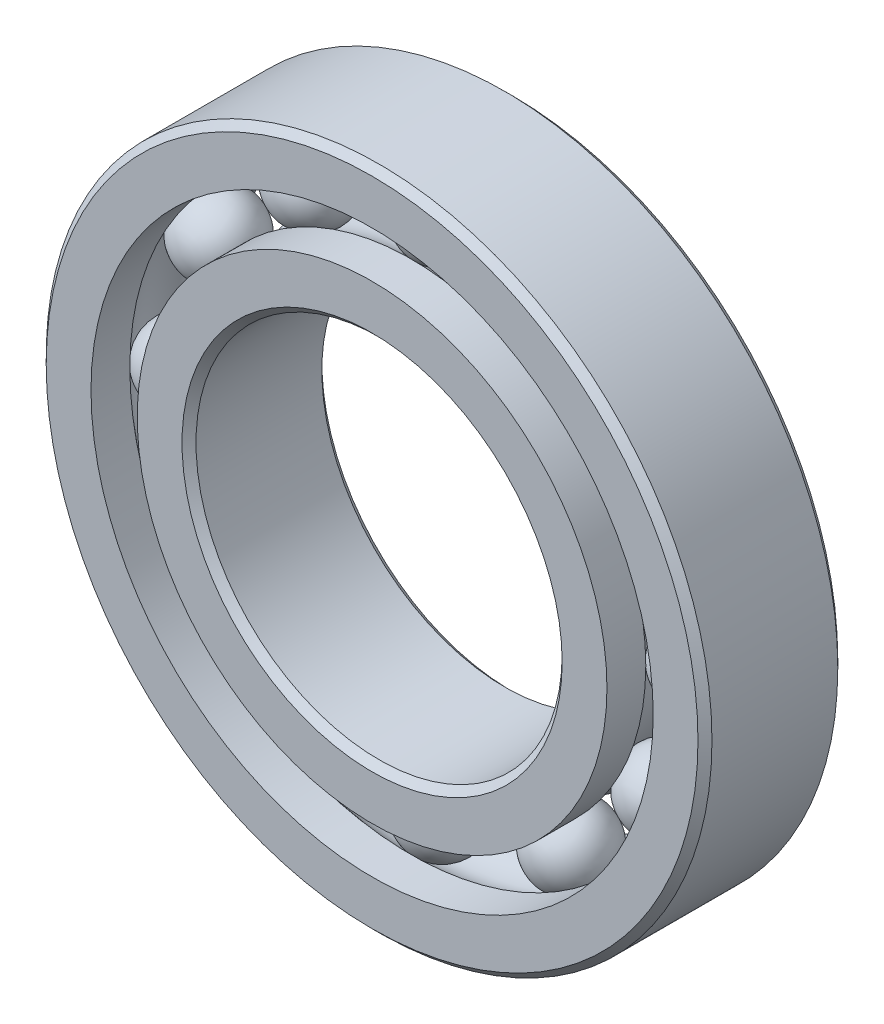
ISO-10303-21;
HEADER;
FILE_DESCRIPTION(('STEP AP214'),'2;1');
FILE_NAME('part.step','',(''),(''),'','','');
FILE_SCHEMA(('AUTOMOTIVE_DESIGN { 1 0 10303 214 1 1 1 1 }'));
ENDSEC;
DATA;
#1=APPLICATION_CONTEXT('core data for automotive mechanical design processes');
#2=APPLICATION_PROTOCOL_DEFINITION('international standard','automotive_design',2000,#1);
#3=PRODUCT_CONTEXT('',#1,'mechanical');
#4=PRODUCT('Part','Part','',(#3));
#5=PRODUCT_RELATED_PRODUCT_CATEGORY('part','',(#4));
#6=PRODUCT_DEFINITION_FORMATION('','',#4);
#7=PRODUCT_DEFINITION_CONTEXT('part definition',#1,'design');
#8=PRODUCT_DEFINITION('design','',#6,#7);
#9=PRODUCT_DEFINITION_SHAPE('','',#8);
#10=(LENGTH_UNIT() NAMED_UNIT(*) SI_UNIT(.MILLI.,.METRE.));
#11=(NAMED_UNIT(*) PLANE_ANGLE_UNIT() SI_UNIT($,.RADIAN.));
#12=(NAMED_UNIT(*) SI_UNIT($,.STERADIAN.) SOLID_ANGLE_UNIT());
#13=UNCERTAINTY_MEASURE_WITH_UNIT(LENGTH_MEASURE(1.E-05),#10,'distance_accuracy_value','');
#14=(GEOMETRIC_REPRESENTATION_CONTEXT(3) GLOBAL_UNCERTAINTY_ASSIGNED_CONTEXT((#13)) GLOBAL_UNIT_ASSIGNED_CONTEXT((#10,
#11,#12)) REPRESENTATION_CONTEXT('',''));
#15=CARTESIAN_POINT('',(0.,0.,0.));
#16=DIRECTION('',(0.,0.,1.));
#17=DIRECTION('',(1.,0.,0.));
#18=AXIS2_PLACEMENT_3D('',#15,#16,#17);
#19=CARTESIAN_POINT('',(-19.3749999999996,33.5584843966472,0.));
#20=DIRECTION('',(0.,0.,1.));
#21=DIRECTION('',(-0.499999999999989,0.866025403784445,0.));
#22=AXIS2_PLACEMENT_3D('',#19,#20,#21);
#23=SPHERICAL_SURFACE('',#22,5.81689133689428);
#24=CARTESIAN_POINT('',(-19.3749999999996,33.5584843966472,5.81689133689428));
#25=VERTEX_POINT('',#24);
#26=VERTEX_LOOP('',#25);
#27=FACE_BOUND('',#26,.T.);
#28=ADVANCED_FACE('F38',(#27),#23,.T.);
#29=CLOSED_SHELL('',(#28));
#30=MANIFOLD_SOLID_BREP('B2',#29);
#31=CARTESIAN_POINT('',(-33.5584843966468,19.3750000000004,0.));
#32=DIRECTION('',(0.,0.,1.));
#33=DIRECTION('',(-0.866025403784433,0.50000000000001,0.));
#34=AXIS2_PLACEMENT_3D('',#31,#32,#33);
#35=SPHERICAL_SURFACE('',#34,5.81689133689428);
#36=CARTESIAN_POINT('',(-33.5584843966468,19.3750000000004,5.81689133689428));
#37=VERTEX_POINT('',#36);
#38=VERTEX_LOOP('',#37);
#39=FACE_BOUND('',#38,.T.);
#40=ADVANCED_FACE('F59',(#39),#35,.T.);
#41=CLOSED_SHELL('',(#40));
#42=MANIFOLD_SOLID_BREP('B6',#41);
#43=CARTESIAN_POINT('',(-38.75,4.05884705640514E-13,0.));
#44=DIRECTION('',(0.,0.,1.));
#45=DIRECTION('',(-1.,0.,0.));
#46=AXIS2_PLACEMENT_3D('',#43,#44,#45);
#47=SPHERICAL_SURFACE('',#46,5.81689133689428);
#48=CARTESIAN_POINT('',(-38.75,4.05884705640514E-13,5.81689133689428));
#49=VERTEX_POINT('',#48);
#50=VERTEX_LOOP('',#49);
#51=FACE_BOUND('',#50,.T.);
#52=ADVANCED_FACE('F80',(#51),#47,.T.);
#53=CLOSED_SHELL('',(#52));
#54=MANIFOLD_SOLID_BREP('B34',#53);
#55=CARTESIAN_POINT('',(-33.5584843966472,-19.3749999999997,0.));
#56=DIRECTION('',(0.,0.,1.));
#57=DIRECTION('',(-0.866025403784443,-0.499999999999992,0.));
#58=AXIS2_PLACEMENT_3D('',#55,#56,#57);
#59=SPHERICAL_SURFACE('',#58,5.81689133689428);
#60=CARTESIAN_POINT('',(-33.5584843966472,-19.3749999999997,5.81689133689428));
#61=VERTEX_POINT('',#60);
#62=VERTEX_LOOP('',#61);
#63=FACE_BOUND('',#62,.T.);
#64=ADVANCED_FACE('F101',(#63),#59,.T.);
#65=CLOSED_SHELL('',(#64));
#66=MANIFOLD_SOLID_BREP('B55',#65);
#67=CARTESIAN_POINT('',(-19.3750000000003,-33.5584843966468,0.));
#68=DIRECTION('',(0.,0.,1.));
#69=DIRECTION('',(-0.500000000000007,-0.866025403784435,0.));
#70=AXIS2_PLACEMENT_3D('',#67,#68,#69);
#71=SPHERICAL_SURFACE('',#70,5.81689133689428);
#72=CARTESIAN_POINT('',(-19.3750000000003,-33.5584843966468,5.81689133689428));
#73=VERTEX_POINT('',#72);
#74=VERTEX_LOOP('',#73);
#75=FACE_BOUND('',#74,.T.);
#76=ADVANCED_FACE('F122',(#75),#71,.T.);
#77=CLOSED_SHELL('',(#76));
#78=MANIFOLD_SOLID_BREP('B76',#77);
#79=CARTESIAN_POINT('',(-2.70589803760343E-13,-38.75,0.));
#80=DIRECTION('',(0.,0.,1.));
#81=DIRECTION('',(0.,-1.,0.));
#82=AXIS2_PLACEMENT_3D('',#79,#80,#81);
#83=SPHERICAL_SURFACE('',#82,5.81689133689428);
#84=CARTESIAN_POINT('',(-2.70589803760343E-13,-38.75,5.81689133689428));
#85=VERTEX_POINT('',#84);
#86=VERTEX_LOOP('',#85);
#87=FACE_BOUND('',#86,.T.);
#88=ADVANCED_FACE('F143',(#87),#83,.T.);
#89=CLOSED_SHELL('',(#88));
#90=MANIFOLD_SOLID_BREP('B97',#89);
#91=CARTESIAN_POINT('',(19.3749999999998,-33.5584843966471,0.));
#92=DIRECTION('',(0.,0.,1.));
#93=DIRECTION('',(0.499999999999995,-0.866025403784442,0.));
#94=AXIS2_PLACEMENT_3D('',#91,#92,#93);
#95=SPHERICAL_SURFACE('',#94,5.81689133689428);
#96=CARTESIAN_POINT('',(19.3749999999998,-33.5584843966471,5.81689133689428));
#97=VERTEX_POINT('',#96);
#98=VERTEX_LOOP('',#97);
#99=FACE_BOUND('',#98,.T.);
#100=ADVANCED_FACE('F164',(#99),#95,.T.);
#101=CLOSED_SHELL('',(#100));
#102=MANIFOLD_SOLID_BREP('B118',#101);
#103=CARTESIAN_POINT('',(33.5584843966469,-19.3750000000002,0.));
#104=DIRECTION('',(0.,0.,1.));
#105=DIRECTION('',(0.866025403784436,-0.500000000000004,0.));
#106=AXIS2_PLACEMENT_3D('',#103,#104,#105);
#107=SPHERICAL_SURFACE('',#106,5.81689133689428);
#108=CARTESIAN_POINT('',(33.5584843966469,-19.3750000000002,5.81689133689428));
#109=VERTEX_POINT('',#108);
#110=VERTEX_LOOP('',#109);
#111=FACE_BOUND('',#110,.T.);
#112=ADVANCED_FACE('F185',(#111),#107,.T.);
#113=CLOSED_SHELL('',(#112));
#114=MANIFOLD_SOLID_BREP('B139',#113);
#115=CARTESIAN_POINT('',(38.75,-1.35294901880171E-13,0.));
#116=DIRECTION('',(0.,0.,1.));
#117=DIRECTION('',(1.,0.,0.));
#118=AXIS2_PLACEMENT_3D('',#115,#116,#117);
#119=SPHERICAL_SURFACE('',#118,5.81689133689428);
#120=CARTESIAN_POINT('',(38.75,-1.35294901880171E-13,5.81689133689428));
#121=VERTEX_POINT('',#120);
#122=VERTEX_LOOP('',#121);
#123=FACE_BOUND('',#122,.T.);
#124=ADVANCED_FACE('F206',(#123),#119,.T.);
#125=CLOSED_SHELL('',(#124));
#126=MANIFOLD_SOLID_BREP('B160',#125);
#127=CARTESIAN_POINT('',(33.558484396647,19.3749999999999,0.));
#128=DIRECTION('',(0.,0.,1.));
#129=DIRECTION('',(0.86602540378444,0.499999999999998,0.));
#130=AXIS2_PLACEMENT_3D('',#127,#128,#129);
#131=SPHERICAL_SURFACE('',#130,5.81689133689428);
#132=CARTESIAN_POINT('',(33.558484396647,19.3749999999999,5.81689133689428));
#133=VERTEX_POINT('',#132);
#134=VERTEX_LOOP('',#133);
#135=FACE_BOUND('',#134,.T.);
#136=ADVANCED_FACE('F227',(#135),#131,.T.);
#137=CLOSED_SHELL('',(#136));
#138=MANIFOLD_SOLID_BREP('B181',#137);
#139=CARTESIAN_POINT('',(19.375,33.558484396647,0.));
#140=DIRECTION('',(0.,0.,1.));
#141=DIRECTION('',(0.500000000000001,0.866025403784438,0.));
#142=AXIS2_PLACEMENT_3D('',#139,#140,#141);
#143=SPHERICAL_SURFACE('',#142,5.81689133689428);
#144=CARTESIAN_POINT('',(19.375,33.558484396647,5.81689133689428));
#145=VERTEX_POINT('',#144);
#146=VERTEX_LOOP('',#145);
#147=FACE_BOUND('',#146,.T.);
#148=ADVANCED_FACE('F248',(#147),#143,.T.);
#149=CLOSED_SHELL('',(#148));
#150=MANIFOLD_SOLID_BREP('B202',#149);
#151=CARTESIAN_POINT('',(0.,38.75,0.));
#152=DIRECTION('',(0.,0.,1.));
#153=DIRECTION('',(0.,1.,0.));
#154=AXIS2_PLACEMENT_3D('',#151,#152,#153);
#155=SPHERICAL_SURFACE('',#154,5.81689133689428);
#156=CARTESIAN_POINT('',(0.,38.75,5.81689133689428));
#157=VERTEX_POINT('',#156);
#158=VERTEX_LOOP('',#157);
#159=FACE_BOUND('',#158,.T.);
#160=ADVANCED_FACE('F271',(#159),#155,.T.);
#161=CLOSED_SHELL('',(#160));
#162=MANIFOLD_SOLID_BREP('B223',#161);
#163=CARTESIAN_POINT('',(0.,35.2774725274725,10.5));
#164=DIRECTION('',(0.,0.,-1.));
#165=DIRECTION('',(-1.,0.,0.));
#166=AXIS2_PLACEMENT_3D('',#163,#164,#165);
#167=PLANE('',#166);
#168=CARTESIAN_POINT('',(0.,0.,10.5));
#169=DIRECTION('',(0.,0.,1.));
#170=DIRECTION('',(1.,0.,0.));
#171=AXIS2_PLACEMENT_3D('',#168,#169,#170);
#172=CIRCLE('',#171,28.55);
#173=CARTESIAN_POINT('',(28.55,0.,10.5));
#174=VERTEX_POINT('',#173);
#175=EDGE_CURVE('E319',#174,#174,#172,.T.);
#176=ORIENTED_EDGE('',*,*,#175,.F.);
#177=EDGE_LOOP('',(#176));
#178=FACE_BOUND('',#177,.T.);
#179=CARTESIAN_POINT('',(0.,0.,10.5));
#180=DIRECTION('',(0.,0.,1.));
#181=DIRECTION('',(1.,0.,0.));
#182=AXIS2_PLACEMENT_3D('',#179,#180,#181);
#183=CIRCLE('',#182,35.2774725274725);
#184=CARTESIAN_POINT('',(35.2774725274725,0.,10.5));
#185=VERTEX_POINT('',#184);
#186=EDGE_CURVE('E270',#185,#185,#183,.T.);
#187=ORIENTED_EDGE('',*,*,#186,.T.);
#188=EDGE_LOOP('',(#187));
#189=FACE_BOUND('',#188,.T.);
#190=ADVANCED_FACE('F291',(#178,#189),#167,.F.);
#191=CARTESIAN_POINT('',(0.,0.,10.5));
#192=DIRECTION('',(0.,0.,1.));
#193=DIRECTION('',(1.,0.,0.));
#194=AXIS2_PLACEMENT_3D('',#191,#192,#193);
#195=CYLINDRICAL_SURFACE('',#194,35.2774725274725);
#196=ORIENTED_EDGE('',*,*,#186,.F.);
#197=EDGE_LOOP('',(#196));
#198=FACE_BOUND('',#197,.T.);
#199=CARTESIAN_POINT('',(0.,0.,4.66666666666667));
#200=DIRECTION('',(0.,0.,1.));
#201=DIRECTION('',(1.,0.,0.));
#202=AXIS2_PLACEMENT_3D('',#199,#200,#201);
#203=CIRCLE('',#202,35.2774725274725);
#204=CARTESIAN_POINT('',(35.2774725274725,0.,4.66666666666667));
#205=VERTEX_POINT('',#204);
#206=EDGE_CURVE('E297',#205,#205,#203,.T.);
#207=ORIENTED_EDGE('',*,*,#206,.T.);
#208=EDGE_LOOP('',(#207));
#209=FACE_BOUND('',#208,.T.);
#210=ADVANCED_FACE('F326',(#198,#209),#195,.T.);
#211=CARTESIAN_POINT('',(0.,0.,0.));
#212=DIRECTION('',(0.,0.,1.));
#213=DIRECTION('',(1.,0.,0.));
#214=AXIS2_PLACEMENT_3D('',#211,#212,#213);
#215=TOROIDAL_SURFACE('',#214,38.75,5.81689133689427);
#216=ORIENTED_EDGE('',*,*,#206,.F.);
#217=EDGE_LOOP('',(#216));
#218=FACE_BOUND('',#217,.T.);
#219=CARTESIAN_POINT('',(0.,0.,-4.66666666666667));
#220=DIRECTION('',(0.,0.,1.));
#221=DIRECTION('',(1.,0.,0.));
#222=AXIS2_PLACEMENT_3D('',#219,#220,#221);
#223=CIRCLE('',#222,35.2774725274725);
#224=CARTESIAN_POINT('',(35.2774725274725,0.,-4.66666666666667));
#225=VERTEX_POINT('',#224);
#226=EDGE_CURVE('E301',#225,#225,#223,.T.);
#227=ORIENTED_EDGE('',*,*,#226,.T.);
#228=EDGE_LOOP('',(#227));
#229=FACE_BOUND('',#228,.T.);
#230=ADVANCED_FACE('F330',(#218,#229),#215,.F.);
#231=CARTESIAN_POINT('',(0.,0.,10.5));
#232=DIRECTION('',(0.,0.,1.));
#233=DIRECTION('',(1.,0.,0.));
#234=AXIS2_PLACEMENT_3D('',#231,#232,#233);
#235=CYLINDRICAL_SURFACE('',#234,35.2774725274725);
#236=ORIENTED_EDGE('',*,*,#226,.F.);
#237=EDGE_LOOP('',(#236));
#238=FACE_BOUND('',#237,.T.);
#239=CARTESIAN_POINT('',(0.,0.,-10.5));
#240=DIRECTION('',(0.,0.,1.));
#241=DIRECTION('',(1.,0.,0.));
#242=AXIS2_PLACEMENT_3D('',#239,#240,#241);
#243=CIRCLE('',#242,35.2774725274725);
#244=CARTESIAN_POINT('',(35.2774725274725,0.,-10.5));
#245=VERTEX_POINT('',#244);
#246=EDGE_CURVE('E305',#245,#245,#243,.T.);
#247=ORIENTED_EDGE('',*,*,#246,.T.);
#248=EDGE_LOOP('',(#247));
#249=FACE_BOUND('',#248,.T.);
#250=ADVANCED_FACE('F335',(#238,#249),#235,.T.);
#251=CARTESIAN_POINT('',(0.,28.55,-10.5));
#252=DIRECTION('',(0.,0.,1.));
#253=DIRECTION('',(1.,0.,0.));
#254=AXIS2_PLACEMENT_3D('',#251,#252,#253);
#255=PLANE('',#254);
#256=ORIENTED_EDGE('',*,*,#246,.F.);
#257=EDGE_LOOP('',(#256));
#258=FACE_BOUND('',#257,.T.);
#259=CARTESIAN_POINT('',(0.,0.,-10.5));
#260=DIRECTION('',(0.,0.,1.));
#261=DIRECTION('',(1.,0.,0.));
#262=AXIS2_PLACEMENT_3D('',#259,#260,#261);
#263=CIRCLE('',#262,28.55);
#264=CARTESIAN_POINT('',(28.55,0.,-10.5));
#265=VERTEX_POINT('',#264);
#266=EDGE_CURVE('E310',#265,#265,#263,.T.);
#267=ORIENTED_EDGE('',*,*,#266,.T.);
#268=EDGE_LOOP('',(#267));
#269=FACE_BOUND('',#268,.T.);
#270=ADVANCED_FACE('F341',(#258,#269),#255,.F.);
#271=CARTESIAN_POINT('',(0.,0.,-9.45000000000001));
#272=DIRECTION('',(0.,0.,-1.));
#273=DIRECTION('',(-1.,0.,0.));
#274=AXIS2_PLACEMENT_3D('',#271,#272,#273);
#275=CONICAL_SURFACE('',#274,27.5,0.785398163397453);
#276=ORIENTED_EDGE('',*,*,#266,.F.);
#277=EDGE_LOOP('',(#276));
#278=FACE_BOUND('',#277,.T.);
#279=CARTESIAN_POINT('',(0.,0.,-9.45000000000001));
#280=DIRECTION('',(0.,0.,1.));
#281=DIRECTION('',(1.,0.,0.));
#282=AXIS2_PLACEMENT_3D('',#279,#280,#281);
#283=CIRCLE('',#282,27.5);
#284=CARTESIAN_POINT('',(27.5,0.,-9.45000000000001));
#285=VERTEX_POINT('',#284);
#286=EDGE_CURVE('E313',#285,#285,#283,.T.);
#287=ORIENTED_EDGE('',*,*,#286,.T.);
#288=EDGE_LOOP('',(#287));
#289=FACE_BOUND('',#288,.T.);
#290=ADVANCED_FACE('F345',(#278,#289),#275,.F.);
#291=CARTESIAN_POINT('',(0.,0.,10.5));
#292=DIRECTION('',(0.,0.,1.));
#293=DIRECTION('',(1.,0.,0.));
#294=AXIS2_PLACEMENT_3D('',#291,#292,#293);
#295=CYLINDRICAL_SURFACE('',#294,27.5);
#296=ORIENTED_EDGE('',*,*,#286,.F.);
#297=EDGE_LOOP('',(#296));
#298=FACE_BOUND('',#297,.T.);
#299=CARTESIAN_POINT('',(0.,0.,9.45));
#300=DIRECTION('',(0.,0.,1.));
#301=DIRECTION('',(1.,0.,0.));
#302=AXIS2_PLACEMENT_3D('',#299,#300,#301);
#303=CIRCLE('',#302,27.5);
#304=CARTESIAN_POINT('',(27.5,0.,9.45));
#305=VERTEX_POINT('',#304);
#306=EDGE_CURVE('E316',#305,#305,#303,.T.);
#307=ORIENTED_EDGE('',*,*,#306,.T.);
#308=EDGE_LOOP('',(#307));
#309=FACE_BOUND('',#308,.T.);
#310=ADVANCED_FACE('F349',(#298,#309),#295,.F.);
#311=CARTESIAN_POINT('',(0.,0.,10.5));
#312=DIRECTION('',(0.,0.,1.));
#313=DIRECTION('',(1.,0.,0.));
#314=AXIS2_PLACEMENT_3D('',#311,#312,#313);
#315=CONICAL_SURFACE('',#314,28.55,0.785398163397441);
#316=ORIENTED_EDGE('',*,*,#306,.F.);
#317=EDGE_LOOP('',(#316));
#318=FACE_BOUND('',#317,.T.);
#319=ORIENTED_EDGE('',*,*,#175,.T.);
#320=EDGE_LOOP('',(#319));
#321=FACE_BOUND('',#320,.T.);
#322=ADVANCED_FACE('F323',(#318,#321),#315,.F.);
#323=CLOSED_SHELL('',(#190,#210,#230,#250,#270,#290,#310,#322));
#324=MANIFOLD_SOLID_BREP('B244',#323);
#325=CARTESIAN_POINT('',(0.,0.,9.45000000000001));
#326=DIRECTION('',(0.,0.,-1.));
#327=DIRECTION('',(-1.,0.,0.));
#328=AXIS2_PLACEMENT_3D('',#325,#326,#327);
#329=CONICAL_SURFACE('',#328,50.,0.78539816339745);
#330=CARTESIAN_POINT('',(0.,0.,10.5));
#331=DIRECTION('',(0.,0.,1.));
#332=DIRECTION('',(1.,0.,0.));
#333=AXIS2_PLACEMENT_3D('',#330,#331,#332);
#334=CIRCLE('',#333,48.95);
#335=CARTESIAN_POINT('',(48.95,0.,10.5));
#336=VERTEX_POINT('',#335);
#337=EDGE_CURVE('E441',#336,#336,#334,.T.);
#338=ORIENTED_EDGE('',*,*,#337,.F.);
#339=EDGE_LOOP('',(#338));
#340=FACE_BOUND('',#339,.T.);
#341=CARTESIAN_POINT('',(0.,0.,9.45000000000001));
#342=DIRECTION('',(0.,0.,1.));
#343=DIRECTION('',(1.,0.,0.));
#344=AXIS2_PLACEMENT_3D('',#341,#342,#343);
#345=CIRCLE('',#344,50.);
#346=CARTESIAN_POINT('',(50.,0.,9.45000000000001));
#347=VERTEX_POINT('',#346);
#348=EDGE_CURVE('E290',#347,#347,#345,.T.);
#349=ORIENTED_EDGE('',*,*,#348,.T.);
#350=EDGE_LOOP('',(#349));
#351=FACE_BOUND('',#350,.T.);
#352=ADVANCED_FACE('F413',(#340,#351),#329,.T.);
#353=CARTESIAN_POINT('',(0.,0.,10.5));
#354=DIRECTION('',(0.,0.,1.));
#355=DIRECTION('',(1.,0.,0.));
#356=AXIS2_PLACEMENT_3D('',#353,#354,#355);
#357=CYLINDRICAL_SURFACE('',#356,50.);
#358=ORIENTED_EDGE('',*,*,#348,.F.);
#359=EDGE_LOOP('',(#358));
#360=FACE_BOUND('',#359,.T.);
#361=CARTESIAN_POINT('',(0.,0.,-9.45000000000001));
#362=DIRECTION('',(0.,0.,1.));
#363=DIRECTION('',(1.,0.,0.));
#364=AXIS2_PLACEMENT_3D('',#361,#362,#363);
#365=CIRCLE('',#364,50.);
#366=CARTESIAN_POINT('',(50.,0.,-9.45000000000001));
#367=VERTEX_POINT('',#366);
#368=EDGE_CURVE('E419',#367,#367,#365,.T.);
#369=ORIENTED_EDGE('',*,*,#368,.T.);
#370=EDGE_LOOP('',(#369));
#371=FACE_BOUND('',#370,.T.);
#372=ADVANCED_FACE('F448',(#360,#371),#357,.T.);
#373=CARTESIAN_POINT('',(0.,0.,-10.5));
#374=DIRECTION('',(0.,0.,1.));
#375=DIRECTION('',(1.,0.,0.));
#376=AXIS2_PLACEMENT_3D('',#373,#374,#375);
#377=CONICAL_SURFACE('',#376,48.95,0.785398163397452);
#378=ORIENTED_EDGE('',*,*,#368,.F.);
#379=EDGE_LOOP('',(#378));
#380=FACE_BOUND('',#379,.T.);
#381=CARTESIAN_POINT('',(0.,0.,-10.5));
#382=DIRECTION('',(0.,0.,1.));
#383=DIRECTION('',(1.,0.,0.));
#384=AXIS2_PLACEMENT_3D('',#381,#382,#383);
#385=CIRCLE('',#384,48.95);
#386=CARTESIAN_POINT('',(48.95,0.,-10.5));
#387=VERTEX_POINT('',#386);
#388=EDGE_CURVE('E423',#387,#387,#385,.T.);
#389=ORIENTED_EDGE('',*,*,#388,.T.);
#390=EDGE_LOOP('',(#389));
#391=FACE_BOUND('',#390,.T.);
#392=ADVANCED_FACE('F452',(#380,#391),#377,.T.);
#393=CARTESIAN_POINT('',(0.,48.95,-10.5));
#394=DIRECTION('',(0.,0.,1.));
#395=DIRECTION('',(1.,0.,0.));
#396=AXIS2_PLACEMENT_3D('',#393,#394,#395);
#397=PLANE('',#396);
#398=ORIENTED_EDGE('',*,*,#388,.F.);
#399=EDGE_LOOP('',(#398));
#400=FACE_BOUND('',#399,.T.);
#401=CARTESIAN_POINT('',(0.,0.,-10.5));
#402=DIRECTION('',(0.,0.,1.));
#403=DIRECTION('',(1.,0.,0.));
#404=AXIS2_PLACEMENT_3D('',#401,#402,#403);
#405=CIRCLE('',#404,42.2225274725275);
#406=CARTESIAN_POINT('',(42.2225274725275,0.,-10.5));
#407=VERTEX_POINT('',#406);
#408=EDGE_CURVE('E427',#407,#407,#405,.T.);
#409=ORIENTED_EDGE('',*,*,#408,.T.);
#410=EDGE_LOOP('',(#409));
#411=FACE_BOUND('',#410,.T.);
#412=ADVANCED_FACE('F457',(#400,#411),#397,.F.);
#413=CARTESIAN_POINT('',(0.,0.,10.5));
#414=DIRECTION('',(0.,0.,1.));
#415=DIRECTION('',(1.,0.,0.));
#416=AXIS2_PLACEMENT_3D('',#413,#414,#415);
#417=CYLINDRICAL_SURFACE('',#416,42.2225274725275);
#418=ORIENTED_EDGE('',*,*,#408,.F.);
#419=EDGE_LOOP('',(#418));
#420=FACE_BOUND('',#419,.T.);
#421=CARTESIAN_POINT('',(0.,0.,-4.66666666666667));
#422=DIRECTION('',(0.,0.,1.));
#423=DIRECTION('',(1.,0.,0.));
#424=AXIS2_PLACEMENT_3D('',#421,#422,#423);
#425=CIRCLE('',#424,42.2225274725275);
#426=CARTESIAN_POINT('',(42.2225274725275,0.,-4.66666666666667));
#427=VERTEX_POINT('',#426);
#428=EDGE_CURVE('E432',#427,#427,#425,.T.);
#429=ORIENTED_EDGE('',*,*,#428,.T.);
#430=EDGE_LOOP('',(#429));
#431=FACE_BOUND('',#430,.T.);
#432=ADVANCED_FACE('F463',(#420,#431),#417,.F.);
#433=CARTESIAN_POINT('',(0.,0.,0.));
#434=DIRECTION('',(0.,0.,1.));
#435=DIRECTION('',(1.,0.,0.));
#436=AXIS2_PLACEMENT_3D('',#433,#434,#435);
#437=TOROIDAL_SURFACE('',#436,38.75,5.81689133689428);
#438=ORIENTED_EDGE('',*,*,#428,.F.);
#439=EDGE_LOOP('',(#438));
#440=FACE_BOUND('',#439,.T.);
#441=CARTESIAN_POINT('',(0.,0.,4.66666666666667));
#442=DIRECTION('',(0.,0.,1.));
#443=DIRECTION('',(1.,0.,0.));
#444=AXIS2_PLACEMENT_3D('',#441,#442,#443);
#445=CIRCLE('',#444,42.2225274725275);
#446=CARTESIAN_POINT('',(42.2225274725275,0.,4.66666666666667));
#447=VERTEX_POINT('',#446);
#448=EDGE_CURVE('E435',#447,#447,#445,.T.);
#449=ORIENTED_EDGE('',*,*,#448,.T.);
#450=EDGE_LOOP('',(#449));
#451=FACE_BOUND('',#450,.T.);
#452=ADVANCED_FACE('F467',(#440,#451),#437,.F.);
#453=CARTESIAN_POINT('',(0.,0.,10.5));
#454=DIRECTION('',(0.,0.,1.));
#455=DIRECTION('',(1.,0.,0.));
#456=AXIS2_PLACEMENT_3D('',#453,#454,#455);
#457=CYLINDRICAL_SURFACE('',#456,42.2225274725275);
#458=ORIENTED_EDGE('',*,*,#448,.F.);
#459=EDGE_LOOP('',(#458));
#460=FACE_BOUND('',#459,.T.);
#461=CARTESIAN_POINT('',(0.,0.,10.5));
#462=DIRECTION('',(0.,0.,1.));
#463=DIRECTION('',(1.,0.,0.));
#464=AXIS2_PLACEMENT_3D('',#461,#462,#463);
#465=CIRCLE('',#464,42.2225274725275);
#466=CARTESIAN_POINT('',(42.2225274725275,0.,10.5));
#467=VERTEX_POINT('',#466);
#468=EDGE_CURVE('E438',#467,#467,#465,.T.);
#469=ORIENTED_EDGE('',*,*,#468,.T.);
#470=EDGE_LOOP('',(#469));
#471=FACE_BOUND('',#470,.T.);
#472=ADVANCED_FACE('F471',(#460,#471),#457,.F.);
#473=CARTESIAN_POINT('',(0.,48.95,10.5));
#474=DIRECTION('',(0.,0.,-1.));
#475=DIRECTION('',(-1.,0.,0.));
#476=AXIS2_PLACEMENT_3D('',#473,#474,#475);
#477=PLANE('',#476);
#478=ORIENTED_EDGE('',*,*,#468,.F.);
#479=EDGE_LOOP('',(#478));
#480=FACE_BOUND('',#479,.T.);
#481=ORIENTED_EDGE('',*,*,#337,.T.);
#482=EDGE_LOOP('',(#481));
#483=FACE_BOUND('',#482,.T.);
#484=ADVANCED_FACE('F445',(#480,#483),#477,.F.);
#485=CLOSED_SHELL('',(#352,#372,#392,#412,#432,#452,#472,#484));
#486=MANIFOLD_SOLID_BREP('B265',#485);
#487=ADVANCED_BREP_SHAPE_REPRESENTATION('',(#18,#30,#42,#54,#66,#78,#90,#102,#114,#126,#138,
#150,#162,#324,#486),#14);
#488=SHAPE_DEFINITION_REPRESENTATION(#9,#487);
ENDSEC;
END-ISO-10303-21;
